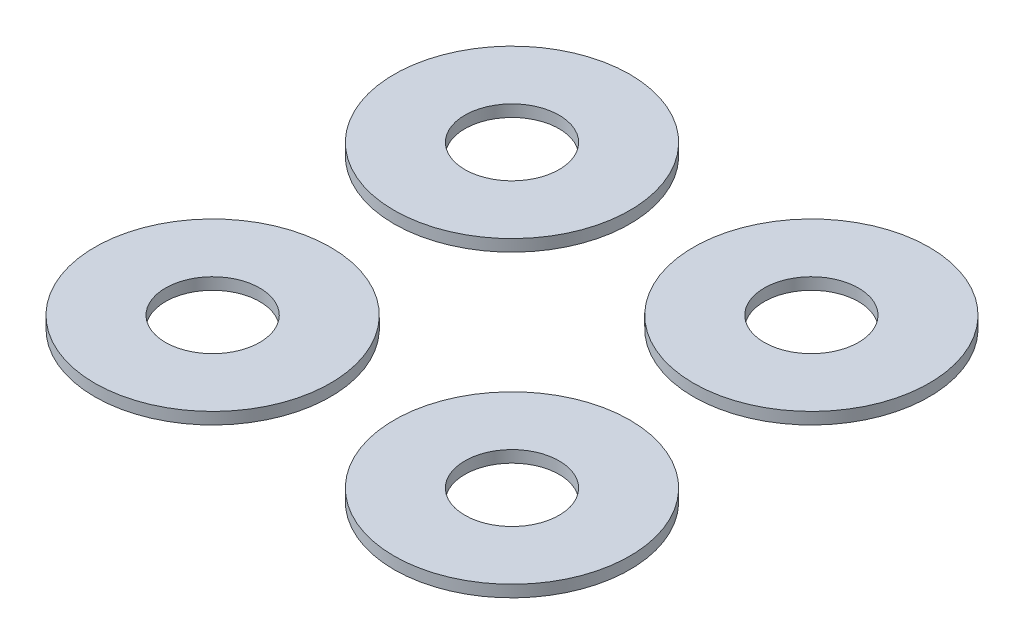
ISO-10303-21;
HEADER;
FILE_DESCRIPTION(('STEP AP214'),'2;1');
FILE_NAME('part.step','',(''),(''),'','','');
FILE_SCHEMA(('AUTOMOTIVE_DESIGN { 1 0 10303 214 1 1 1 1 }'));
ENDSEC;
DATA;
#1=APPLICATION_CONTEXT('core data for automotive mechanical design processes');
#2=APPLICATION_PROTOCOL_DEFINITION('international standard','automotive_design',2000,#1);
#3=PRODUCT_CONTEXT('',#1,'mechanical');
#4=PRODUCT('Part','Part','',(#3));
#5=PRODUCT_RELATED_PRODUCT_CATEGORY('part','',(#4));
#6=PRODUCT_DEFINITION_FORMATION('','',#4);
#7=PRODUCT_DEFINITION_CONTEXT('part definition',#1,'design');
#8=PRODUCT_DEFINITION('design','',#6,#7);
#9=PRODUCT_DEFINITION_SHAPE('','',#8);
#10=(LENGTH_UNIT() NAMED_UNIT(*) SI_UNIT(.MILLI.,.METRE.));
#11=(NAMED_UNIT(*) PLANE_ANGLE_UNIT() SI_UNIT($,.RADIAN.));
#12=(NAMED_UNIT(*) SI_UNIT($,.STERADIAN.) SOLID_ANGLE_UNIT());
#13=UNCERTAINTY_MEASURE_WITH_UNIT(LENGTH_MEASURE(1.E-05),#10,'distance_accuracy_value','');
#14=(GEOMETRIC_REPRESENTATION_CONTEXT(3) GLOBAL_UNCERTAINTY_ASSIGNED_CONTEXT((#13)) GLOBAL_UNIT_ASSIGNED_CONTEXT((#10,
#11,#12)) REPRESENTATION_CONTEXT('',''));
#15=CARTESIAN_POINT('',(0.,0.,0.));
#16=DIRECTION('',(0.,0.,1.));
#17=DIRECTION('',(1.,0.,0.));
#18=AXIS2_PLACEMENT_3D('',#15,#16,#17);
#19=CARTESIAN_POINT('',(2.54,0.1,0.));
#20=DIRECTION('',(0.,1.,0.));
#21=DIRECTION('',(0.,0.,1.));
#22=AXIS2_PLACEMENT_3D('',#19,#20,#21);
#23=PLANE('',#22);
#24=CARTESIAN_POINT('',(2.54,0.1,0.));
#25=DIRECTION('',(0.,1.,0.));
#26=DIRECTION('',(0.,0.,1.));
#27=AXIS2_PLACEMENT_3D('',#24,#25,#26);
#28=CIRCLE('',#27,1.);
#29=CARTESIAN_POINT('',(2.54,0.1,1.));
#30=VERTEX_POINT('',#29);
#31=EDGE_CURVE('E11',#30,#30,#28,.T.);
#32=ORIENTED_EDGE('',*,*,#31,.T.);
#33=EDGE_LOOP('',(#32));
#34=FACE_BOUND('',#33,.T.);
#35=CARTESIAN_POINT('',(2.54,0.1,0.));
#36=DIRECTION('',(0.,1.,0.));
#37=DIRECTION('',(0.,0.,1.));
#38=AXIS2_PLACEMENT_3D('',#35,#36,#37);
#39=CIRCLE('',#38,0.4);
#40=CARTESIAN_POINT('',(2.54,0.1,0.4));
#41=VERTEX_POINT('',#40);
#42=EDGE_CURVE('E51',#41,#41,#39,.T.);
#43=ORIENTED_EDGE('',*,*,#42,.F.);
#44=EDGE_LOOP('',(#43));
#45=FACE_BOUND('',#44,.T.);
#46=ADVANCED_FACE('F40',(#34,#45),#23,.T.);
#47=CARTESIAN_POINT('',(2.54,0.,0.));
#48=DIRECTION('',(0.,1.,0.));
#49=DIRECTION('',(0.,0.,1.));
#50=AXIS2_PLACEMENT_3D('',#47,#48,#49);
#51=PLANE('',#50);
#52=CARTESIAN_POINT('',(2.54,0.,0.));
#53=DIRECTION('',(0.,1.,0.));
#54=DIRECTION('',(0.,0.,1.));
#55=AXIS2_PLACEMENT_3D('',#52,#53,#54);
#56=CIRCLE('',#55,1.);
#57=CARTESIAN_POINT('',(2.54,0.,1.));
#58=VERTEX_POINT('',#57);
#59=EDGE_CURVE('E44',#58,#58,#56,.T.);
#60=ORIENTED_EDGE('',*,*,#59,.F.);
#61=EDGE_LOOP('',(#60));
#62=FACE_BOUND('',#61,.T.);
#63=CARTESIAN_POINT('',(2.54,0.,0.));
#64=DIRECTION('',(0.,1.,0.));
#65=DIRECTION('',(0.,0.,1.));
#66=AXIS2_PLACEMENT_3D('',#63,#64,#65);
#67=CIRCLE('',#66,0.4);
#68=CARTESIAN_POINT('',(2.54,0.,0.4));
#69=VERTEX_POINT('',#68);
#70=EDGE_CURVE('E53',#69,#69,#67,.T.);
#71=ORIENTED_EDGE('',*,*,#70,.T.);
#72=EDGE_LOOP('',(#71));
#73=FACE_BOUND('',#72,.T.);
#74=ADVANCED_FACE('F63',(#62,#73),#51,.F.);
#75=CARTESIAN_POINT('',(2.54,0.1,0.));
#76=DIRECTION('',(0.,-1.,0.));
#77=DIRECTION('',(0.,0.,-1.));
#78=AXIS2_PLACEMENT_3D('',#75,#76,#77);
#79=CYLINDRICAL_SURFACE('',#78,1.);
#80=ORIENTED_EDGE('',*,*,#31,.F.);
#81=EDGE_LOOP('',(#80));
#82=FACE_BOUND('',#81,.T.);
#83=ORIENTED_EDGE('',*,*,#59,.T.);
#84=EDGE_LOOP('',(#83));
#85=FACE_BOUND('',#84,.T.);
#86=ADVANCED_FACE('F42',(#82,#85),#79,.T.);
#87=CARTESIAN_POINT('',(2.54,0.1,0.));
#88=DIRECTION('',(0.,-1.,0.));
#89=DIRECTION('',(0.,0.,-1.));
#90=AXIS2_PLACEMENT_3D('',#87,#88,#89);
#91=CYLINDRICAL_SURFACE('',#90,0.4);
#92=ORIENTED_EDGE('',*,*,#42,.T.);
#93=EDGE_LOOP('',(#92));
#94=FACE_BOUND('',#93,.T.);
#95=ORIENTED_EDGE('',*,*,#70,.F.);
#96=EDGE_LOOP('',(#95));
#97=FACE_BOUND('',#96,.T.);
#98=ADVANCED_FACE('F59',(#94,#97),#91,.F.);
#99=CLOSED_SHELL('',(#46,#74,#86,#98));
#100=MANIFOLD_SOLID_BREP('B2',#99);
#101=CARTESIAN_POINT('',(2.54,0.1,-2.54));
#102=DIRECTION('',(0.,1.,0.));
#103=DIRECTION('',(0.,0.,1.));
#104=AXIS2_PLACEMENT_3D('',#101,#102,#103);
#105=PLANE('',#104);
#106=CARTESIAN_POINT('',(2.54,0.1,-2.54));
#107=DIRECTION('',(0.,1.,0.));
#108=DIRECTION('',(0.,0.,1.));
#109=AXIS2_PLACEMENT_3D('',#106,#107,#108);
#110=CIRCLE('',#109,1.);
#111=CARTESIAN_POINT('',(2.54,0.1,-1.54));
#112=VERTEX_POINT('',#111);
#113=EDGE_CURVE('E39',#112,#112,#110,.T.);
#114=ORIENTED_EDGE('',*,*,#113,.T.);
#115=EDGE_LOOP('',(#114));
#116=FACE_BOUND('',#115,.T.);
#117=CARTESIAN_POINT('',(2.54,0.1,-2.54));
#118=DIRECTION('',(0.,1.,0.));
#119=DIRECTION('',(0.,0.,1.));
#120=AXIS2_PLACEMENT_3D('',#117,#118,#119);
#121=CIRCLE('',#120,0.4);
#122=CARTESIAN_POINT('',(2.54,0.1,-2.14));
#123=VERTEX_POINT('',#122);
#124=EDGE_CURVE('E121',#123,#123,#121,.T.);
#125=ORIENTED_EDGE('',*,*,#124,.F.);
#126=EDGE_LOOP('',(#125));
#127=FACE_BOUND('',#126,.T.);
#128=ADVANCED_FACE('F110',(#116,#127),#105,.T.);
#129=CARTESIAN_POINT('',(2.54,0.,-2.54));
#130=DIRECTION('',(0.,1.,0.));
#131=DIRECTION('',(0.,0.,1.));
#132=AXIS2_PLACEMENT_3D('',#129,#130,#131);
#133=PLANE('',#132);
#134=CARTESIAN_POINT('',(2.54,0.,-2.54));
#135=DIRECTION('',(0.,1.,0.));
#136=DIRECTION('',(0.,0.,1.));
#137=AXIS2_PLACEMENT_3D('',#134,#135,#136);
#138=CIRCLE('',#137,1.);
#139=CARTESIAN_POINT('',(2.54,0.,-1.54));
#140=VERTEX_POINT('',#139);
#141=EDGE_CURVE('E114',#140,#140,#138,.T.);
#142=ORIENTED_EDGE('',*,*,#141,.F.);
#143=EDGE_LOOP('',(#142));
#144=FACE_BOUND('',#143,.T.);
#145=CARTESIAN_POINT('',(2.54,0.,-2.54));
#146=DIRECTION('',(0.,1.,0.));
#147=DIRECTION('',(0.,0.,1.));
#148=AXIS2_PLACEMENT_3D('',#145,#146,#147);
#149=CIRCLE('',#148,0.4);
#150=CARTESIAN_POINT('',(2.54,0.,-2.14));
#151=VERTEX_POINT('',#150);
#152=EDGE_CURVE('E123',#151,#151,#149,.T.);
#153=ORIENTED_EDGE('',*,*,#152,.T.);
#154=EDGE_LOOP('',(#153));
#155=FACE_BOUND('',#154,.T.);
#156=ADVANCED_FACE('F133',(#144,#155),#133,.F.);
#157=CARTESIAN_POINT('',(2.54,0.1,-2.54));
#158=DIRECTION('',(0.,-1.,0.));
#159=DIRECTION('',(0.,0.,-1.));
#160=AXIS2_PLACEMENT_3D('',#157,#158,#159);
#161=CYLINDRICAL_SURFACE('',#160,1.);
#162=ORIENTED_EDGE('',*,*,#113,.F.);
#163=EDGE_LOOP('',(#162));
#164=FACE_BOUND('',#163,.T.);
#165=ORIENTED_EDGE('',*,*,#141,.T.);
#166=EDGE_LOOP('',(#165));
#167=FACE_BOUND('',#166,.T.);
#168=ADVANCED_FACE('F112',(#164,#167),#161,.T.);
#169=CARTESIAN_POINT('',(2.54,0.1,-2.54));
#170=DIRECTION('',(0.,-1.,0.));
#171=DIRECTION('',(0.,0.,-1.));
#172=AXIS2_PLACEMENT_3D('',#169,#170,#171);
#173=CYLINDRICAL_SURFACE('',#172,0.4);
#174=ORIENTED_EDGE('',*,*,#124,.T.);
#175=EDGE_LOOP('',(#174));
#176=FACE_BOUND('',#175,.T.);
#177=ORIENTED_EDGE('',*,*,#152,.F.);
#178=EDGE_LOOP('',(#177));
#179=FACE_BOUND('',#178,.T.);
#180=ADVANCED_FACE('F129',(#176,#179),#173,.F.);
#181=CLOSED_SHELL('',(#128,#156,#168,#180));
#182=MANIFOLD_SOLID_BREP('B6',#181);
#183=CARTESIAN_POINT('',(0.,0.1,-2.54));
#184=DIRECTION('',(0.,1.,0.));
#185=DIRECTION('',(0.,0.,1.));
#186=AXIS2_PLACEMENT_3D('',#183,#184,#185);
#187=PLANE('',#186);
#188=CARTESIAN_POINT('',(0.,0.1,-2.54));
#189=DIRECTION('',(0.,1.,0.));
#190=DIRECTION('',(0.,0.,1.));
#191=AXIS2_PLACEMENT_3D('',#188,#189,#190);
#192=CIRCLE('',#191,1.);
#193=CARTESIAN_POINT('',(0.,0.1,-1.54));
#194=VERTEX_POINT('',#193);
#195=EDGE_CURVE('E109',#194,#194,#192,.T.);
#196=ORIENTED_EDGE('',*,*,#195,.T.);
#197=EDGE_LOOP('',(#196));
#198=FACE_BOUND('',#197,.T.);
#199=CARTESIAN_POINT('',(0.,0.1,-2.54));
#200=DIRECTION('',(0.,1.,0.));
#201=DIRECTION('',(0.,0.,1.));
#202=AXIS2_PLACEMENT_3D('',#199,#200,#201);
#203=CIRCLE('',#202,0.4);
#204=CARTESIAN_POINT('',(0.,0.1,-2.14));
#205=VERTEX_POINT('',#204);
#206=EDGE_CURVE('E190',#205,#205,#203,.T.);
#207=ORIENTED_EDGE('',*,*,#206,.F.);
#208=EDGE_LOOP('',(#207));
#209=FACE_BOUND('',#208,.T.);
#210=ADVANCED_FACE('F179',(#198,#209),#187,.T.);
#211=CARTESIAN_POINT('',(0.,0.,-2.54));
#212=DIRECTION('',(0.,1.,0.));
#213=DIRECTION('',(0.,0.,1.));
#214=AXIS2_PLACEMENT_3D('',#211,#212,#213);
#215=PLANE('',#214);
#216=CARTESIAN_POINT('',(0.,0.,-2.54));
#217=DIRECTION('',(0.,1.,0.));
#218=DIRECTION('',(0.,0.,1.));
#219=AXIS2_PLACEMENT_3D('',#216,#217,#218);
#220=CIRCLE('',#219,1.);
#221=CARTESIAN_POINT('',(0.,0.,-1.54));
#222=VERTEX_POINT('',#221);
#223=EDGE_CURVE('E183',#222,#222,#220,.T.);
#224=ORIENTED_EDGE('',*,*,#223,.F.);
#225=EDGE_LOOP('',(#224));
#226=FACE_BOUND('',#225,.T.);
#227=CARTESIAN_POINT('',(0.,0.,-2.54));
#228=DIRECTION('',(0.,1.,0.));
#229=DIRECTION('',(0.,0.,1.));
#230=AXIS2_PLACEMENT_3D('',#227,#228,#229);
#231=CIRCLE('',#230,0.4);
#232=CARTESIAN_POINT('',(0.,0.,-2.14));
#233=VERTEX_POINT('',#232);
#234=EDGE_CURVE('E192',#233,#233,#231,.T.);
#235=ORIENTED_EDGE('',*,*,#234,.T.);
#236=EDGE_LOOP('',(#235));
#237=FACE_BOUND('',#236,.T.);
#238=ADVANCED_FACE('F202',(#226,#237),#215,.F.);
#239=CARTESIAN_POINT('',(0.,0.1,-2.54));
#240=DIRECTION('',(0.,-1.,0.));
#241=DIRECTION('',(0.,0.,-1.));
#242=AXIS2_PLACEMENT_3D('',#239,#240,#241);
#243=CYLINDRICAL_SURFACE('',#242,1.);
#244=ORIENTED_EDGE('',*,*,#195,.F.);
#245=EDGE_LOOP('',(#244));
#246=FACE_BOUND('',#245,.T.);
#247=ORIENTED_EDGE('',*,*,#223,.T.);
#248=EDGE_LOOP('',(#247));
#249=FACE_BOUND('',#248,.T.);
#250=ADVANCED_FACE('F181',(#246,#249),#243,.T.);
#251=CARTESIAN_POINT('',(0.,0.1,-2.54));
#252=DIRECTION('',(0.,-1.,0.));
#253=DIRECTION('',(0.,0.,-1.));
#254=AXIS2_PLACEMENT_3D('',#251,#252,#253);
#255=CYLINDRICAL_SURFACE('',#254,0.4);
#256=ORIENTED_EDGE('',*,*,#206,.T.);
#257=EDGE_LOOP('',(#256));
#258=FACE_BOUND('',#257,.T.);
#259=ORIENTED_EDGE('',*,*,#234,.F.);
#260=EDGE_LOOP('',(#259));
#261=FACE_BOUND('',#260,.T.);
#262=ADVANCED_FACE('F198',(#258,#261),#255,.F.);
#263=CLOSED_SHELL('',(#210,#238,#250,#262));
#264=MANIFOLD_SOLID_BREP('B34',#263);
#265=CARTESIAN_POINT('',(0.,0.1,0.));
#266=DIRECTION('',(0.,1.,0.));
#267=DIRECTION('',(0.,0.,1.));
#268=AXIS2_PLACEMENT_3D('',#265,#266,#267);
#269=PLANE('',#268);
#270=CARTESIAN_POINT('',(0.,0.1,0.));
#271=DIRECTION('',(0.,1.,0.));
#272=DIRECTION('',(0.,0.,1.));
#273=AXIS2_PLACEMENT_3D('',#270,#271,#272);
#274=CIRCLE('',#273,1.);
#275=CARTESIAN_POINT('',(0.,0.1,1.));
#276=VERTEX_POINT('',#275);
#277=EDGE_CURVE('E178',#276,#276,#274,.T.);
#278=ORIENTED_EDGE('',*,*,#277,.T.);
#279=EDGE_LOOP('',(#278));
#280=FACE_BOUND('',#279,.T.);
#281=CARTESIAN_POINT('',(0.,0.1,0.));
#282=DIRECTION('',(0.,1.,0.));
#283=DIRECTION('',(0.,0.,1.));
#284=AXIS2_PLACEMENT_3D('',#281,#282,#283);
#285=CIRCLE('',#284,0.399999999999999);
#286=CARTESIAN_POINT('',(0.,0.1,0.399999999999999));
#287=VERTEX_POINT('',#286);
#288=EDGE_CURVE('E252',#287,#287,#285,.T.);
#289=ORIENTED_EDGE('',*,*,#288,.F.);
#290=EDGE_LOOP('',(#289));
#291=FACE_BOUND('',#290,.T.);
#292=ADVANCED_FACE('F241',(#280,#291),#269,.T.);
#293=CARTESIAN_POINT('',(0.,0.,0.));
#294=DIRECTION('',(0.,1.,0.));
#295=DIRECTION('',(0.,0.,1.));
#296=AXIS2_PLACEMENT_3D('',#293,#294,#295);
#297=PLANE('',#296);
#298=CARTESIAN_POINT('',(0.,0.,0.));
#299=DIRECTION('',(0.,1.,0.));
#300=DIRECTION('',(0.,0.,1.));
#301=AXIS2_PLACEMENT_3D('',#298,#299,#300);
#302=CIRCLE('',#301,1.);
#303=CARTESIAN_POINT('',(0.,0.,1.));
#304=VERTEX_POINT('',#303);
#305=EDGE_CURVE('E245',#304,#304,#302,.T.);
#306=ORIENTED_EDGE('',*,*,#305,.F.);
#307=EDGE_LOOP('',(#306));
#308=FACE_BOUND('',#307,.T.);
#309=CARTESIAN_POINT('',(0.,0.,0.));
#310=DIRECTION('',(0.,1.,0.));
#311=DIRECTION('',(0.,0.,1.));
#312=AXIS2_PLACEMENT_3D('',#309,#310,#311);
#313=CIRCLE('',#312,0.399999999999999);
#314=CARTESIAN_POINT('',(0.,0.,0.399999999999999));
#315=VERTEX_POINT('',#314);
#316=EDGE_CURVE('E254',#315,#315,#313,.T.);
#317=ORIENTED_EDGE('',*,*,#316,.T.);
#318=EDGE_LOOP('',(#317));
#319=FACE_BOUND('',#318,.T.);
#320=ADVANCED_FACE('F264',(#308,#319),#297,.F.);
#321=CARTESIAN_POINT('',(0.,0.1,0.));
#322=DIRECTION('',(0.,-1.,0.));
#323=DIRECTION('',(0.,0.,-1.));
#324=AXIS2_PLACEMENT_3D('',#321,#322,#323);
#325=CYLINDRICAL_SURFACE('',#324,1.);
#326=ORIENTED_EDGE('',*,*,#277,.F.);
#327=EDGE_LOOP('',(#326));
#328=FACE_BOUND('',#327,.T.);
#329=ORIENTED_EDGE('',*,*,#305,.T.);
#330=EDGE_LOOP('',(#329));
#331=FACE_BOUND('',#330,.T.);
#332=ADVANCED_FACE('F243',(#328,#331),#325,.T.);
#333=CARTESIAN_POINT('',(0.,0.1,0.));
#334=DIRECTION('',(0.,-1.,0.));
#335=DIRECTION('',(0.,0.,-1.));
#336=AXIS2_PLACEMENT_3D('',#333,#334,#335);
#337=CYLINDRICAL_SURFACE('',#336,0.399999999999999);
#338=ORIENTED_EDGE('',*,*,#288,.T.);
#339=EDGE_LOOP('',(#338));
#340=FACE_BOUND('',#339,.T.);
#341=ORIENTED_EDGE('',*,*,#316,.F.);
#342=EDGE_LOOP('',(#341));
#343=FACE_BOUND('',#342,.T.);
#344=ADVANCED_FACE('F260',(#340,#343),#337,.F.);
#345=CLOSED_SHELL('',(#292,#320,#332,#344));
#346=MANIFOLD_SOLID_BREP('B104',#345);
#347=ADVANCED_BREP_SHAPE_REPRESENTATION('',(#18,#100,#182,#264,#346),#14);
#348=SHAPE_DEFINITION_REPRESENTATION(#9,#347);
ENDSEC;
END-ISO-10303-21;
